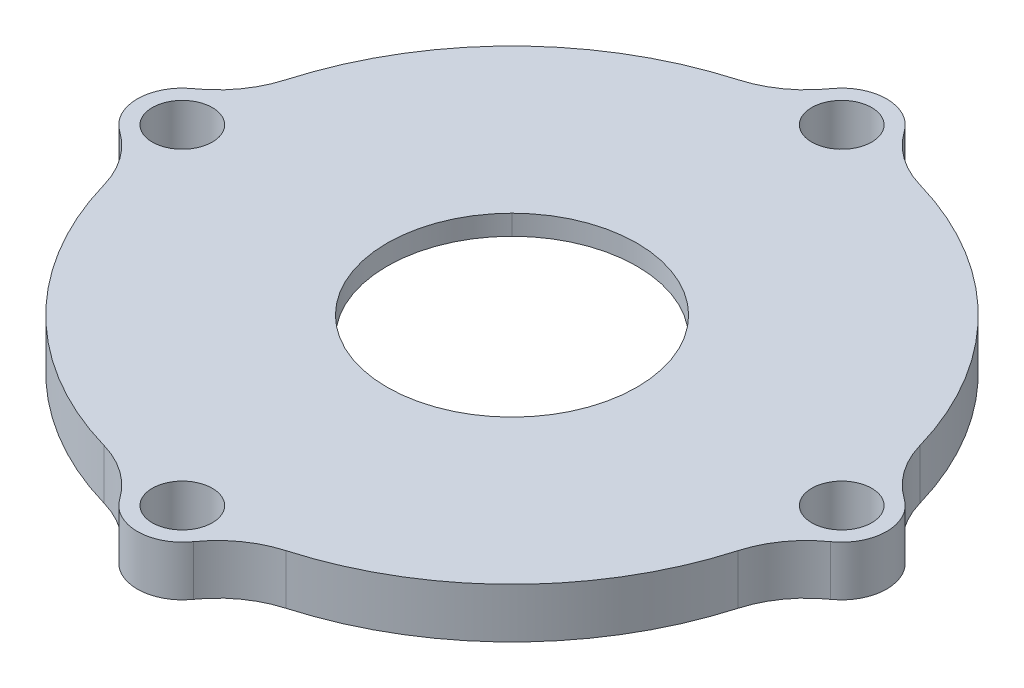
ISO-10303-21;
HEADER;
FILE_DESCRIPTION(('STEP AP214'),'2;1');
FILE_NAME('part.step','',(''),(''),'','','');
FILE_SCHEMA(('AUTOMOTIVE_DESIGN { 1 0 10303 214 1 1 1 1 }'));
ENDSEC;
DATA;
#1=APPLICATION_CONTEXT('core data for automotive mechanical design processes');
#2=APPLICATION_PROTOCOL_DEFINITION('international standard','automotive_design',2000,#1);
#3=PRODUCT_CONTEXT('',#1,'mechanical');
#4=PRODUCT('Part','Part','',(#3));
#5=PRODUCT_RELATED_PRODUCT_CATEGORY('part','',(#4));
#6=PRODUCT_DEFINITION_FORMATION('','',#4);
#7=PRODUCT_DEFINITION_CONTEXT('part definition',#1,'design');
#8=PRODUCT_DEFINITION('design','',#6,#7);
#9=PRODUCT_DEFINITION_SHAPE('','',#8);
#10=(LENGTH_UNIT() NAMED_UNIT(*) SI_UNIT(.MILLI.,.METRE.));
#11=(NAMED_UNIT(*) PLANE_ANGLE_UNIT() SI_UNIT($,.RADIAN.));
#12=(NAMED_UNIT(*) SI_UNIT($,.STERADIAN.) SOLID_ANGLE_UNIT());
#13=UNCERTAINTY_MEASURE_WITH_UNIT(LENGTH_MEASURE(1.E-05),#10,'distance_accuracy_value','');
#14=(GEOMETRIC_REPRESENTATION_CONTEXT(3) GLOBAL_UNCERTAINTY_ASSIGNED_CONTEXT((#13)) GLOBAL_UNIT_ASSIGNED_CONTEXT((#10,
#11,#12)) REPRESENTATION_CONTEXT('',''));
#15=CARTESIAN_POINT('',(0.,0.,0.));
#16=DIRECTION('',(0.,0.,1.));
#17=DIRECTION('',(1.,0.,0.));
#18=AXIS2_PLACEMENT_3D('',#15,#16,#17);
#19=CARTESIAN_POINT('',(0.,5.,0.));
#20=DIRECTION('',(0.,1.,0.));
#21=DIRECTION('',(0.,0.,1.));
#22=AXIS2_PLACEMENT_3D('',#19,#20,#21);
#23=PLANE('',#22);
#24=CARTESIAN_POINT('',(0.00100000000000606,5.,33.001));
#25=DIRECTION('',(0.,1.,0.));
#26=DIRECTION('',(0.,0.,1.));
#27=AXIS2_PLACEMENT_3D('',#24,#25,#26);
#28=CIRCLE('',#27,3.);
#29=CARTESIAN_POINT('',(0.00100000000000606,5.,36.001));
#30=VERTEX_POINT('',#29);
#31=EDGE_CURVE('E310',#30,#30,#28,.T.);
#32=ORIENTED_EDGE('',*,*,#31,.F.);
#33=EDGE_LOOP('',(#32));
#34=FACE_BOUND('',#33,.T.);
#35=CARTESIAN_POINT('',(0.00099999999999999,5.,0.00100000000000694));
#36=DIRECTION('',(0.,1.,0.));
#37=DIRECTION('',(0.,0.,1.));
#38=AXIS2_PLACEMENT_3D('',#35,#36,#37);
#39=CIRCLE('',#38,12.5);
#40=CARTESIAN_POINT('',(-8.83833475068976,5.,8.83933475068967));
#41=VERTEX_POINT('',#40);
#42=CARTESIAN_POINT('',(8.84033475068964,5.,8.83933475068979));
#43=VERTEX_POINT('',#42);
#44=EDGE_CURVE('E313',#41,#43,#39,.T.);
#45=ORIENTED_EDGE('',*,*,#44,.F.);
#46=CARTESIAN_POINT('',(0.,5.,0.));
#47=DIRECTION('',(0.,1.,0.));
#48=DIRECTION('',(0.,0.,1.));
#49=AXIS2_PLACEMENT_3D('',#46,#47,#48);
#50=CIRCLE('',#49,12.5);
#51=CARTESIAN_POINT('',(-8.8383347506897,5.,-8.83933475068973));
#52=VERTEX_POINT('',#51);
#53=EDGE_CURVE('E317',#52,#41,#50,.T.);
#54=ORIENTED_EDGE('',*,*,#53,.F.);
#55=CARTESIAN_POINT('',(0.001,5.,-0.00100000000000694));
#56=DIRECTION('',(0.,1.,0.));
#57=DIRECTION('',(0.,0.,1.));
#58=AXIS2_PLACEMENT_3D('',#55,#56,#57);
#59=CIRCLE('',#58,12.5);
#60=CARTESIAN_POINT('',(8.84033475068976,5.,-8.83933475068966));
#61=VERTEX_POINT('',#60);
#62=EDGE_CURVE('E320',#61,#52,#59,.T.);
#63=ORIENTED_EDGE('',*,*,#62,.F.);
#64=CARTESIAN_POINT('',(0.00200000000000694,5.,0.));
#65=DIRECTION('',(0.,1.,0.));
#66=DIRECTION('',(0.,0.,1.));
#67=AXIS2_PLACEMENT_3D('',#64,#65,#66);
#68=CIRCLE('',#67,12.5);
#69=EDGE_CURVE('E323',#43,#61,#68,.T.);
#70=ORIENTED_EDGE('',*,*,#69,.F.);
#71=EDGE_LOOP('',(#45,#54,#63,#70));
#72=FACE_BOUND('',#71,.T.);
#73=CARTESIAN_POINT('',(33.002,5.,0.));
#74=DIRECTION('',(0.,1.,0.));
#75=DIRECTION('',(0.,0.,1.));
#76=AXIS2_PLACEMENT_3D('',#73,#74,#75);
#77=CIRCLE('',#76,3.);
#78=CARTESIAN_POINT('',(33.002,5.,3.));
#79=VERTEX_POINT('',#78);
#80=EDGE_CURVE('E326',#79,#79,#77,.T.);
#81=ORIENTED_EDGE('',*,*,#80,.F.);
#82=EDGE_LOOP('',(#81));
#83=FACE_BOUND('',#82,.T.);
#84=CARTESIAN_POINT('',(0.000999999999997979,5.,-33.001));
#85=DIRECTION('',(0.,1.,0.));
#86=DIRECTION('',(0.,0.,1.));
#87=AXIS2_PLACEMENT_3D('',#84,#85,#86);
#88=CIRCLE('',#87,3.);
#89=CARTESIAN_POINT('',(0.000999999999997979,5.,-30.001));
#90=VERTEX_POINT('',#89);
#91=EDGE_CURVE('E329',#90,#90,#88,.T.);
#92=ORIENTED_EDGE('',*,*,#91,.F.);
#93=EDGE_LOOP('',(#92));
#94=FACE_BOUND('',#93,.T.);
#95=CARTESIAN_POINT('',(-33.,5.,0.));
#96=DIRECTION('',(0.,1.,0.));
#97=DIRECTION('',(0.,0.,1.));
#98=AXIS2_PLACEMENT_3D('',#95,#96,#97);
#99=CIRCLE('',#98,3.);
#100=CARTESIAN_POINT('',(-33.,5.,3.));
#101=VERTEX_POINT('',#100);
#102=EDGE_CURVE('E332',#101,#101,#99,.T.);
#103=ORIENTED_EDGE('',*,*,#102,.F.);
#104=EDGE_LOOP('',(#103));
#105=FACE_BOUND('',#104,.T.);
#106=CARTESIAN_POINT('',(0.,5.,0.));
#107=DIRECTION('',(0.,-1.,0.));
#108=DIRECTION('',(0.,0.,-1.));
#109=AXIS2_PLACEMENT_3D('',#106,#107,#108);
#110=CIRCLE('',#109,33.);
#111=CARTESIAN_POINT('',(-9.10862232961965,5.,31.718023255814));
#112=VERTEX_POINT('',#111);
#113=CARTESIAN_POINT('',(-31.7180232558139,5.,9.10862232961966));
#114=VERTEX_POINT('',#113);
#115=EDGE_CURVE('E189',#112,#114,#110,.T.);
#116=ORIENTED_EDGE('',*,*,#115,.F.);
#117=CARTESIAN_POINT('',(-11.8688109143529,5.,41.3295454545454));
#118=DIRECTION('',(0.,1.,0.));
#119=DIRECTION('',(0.,0.,1.));
#120=AXIS2_PLACEMENT_3D('',#117,#118,#119);
#121=CIRCLE('',#120,10.);
#122=CARTESIAN_POINT('',(-3.68342407686815,5.,35.5850313479624));
#123=VERTEX_POINT('',#122);
#124=EDGE_CURVE('E51',#123,#112,#121,.T.);
#125=ORIENTED_EDGE('',*,*,#124,.F.);
#126=CARTESIAN_POINT('',(0.,5.,33.));
#127=DIRECTION('',(0.,-1.,0.));
#128=DIRECTION('',(0.,0.,-1.));
#129=AXIS2_PLACEMENT_3D('',#126,#127,#128);
#130=CIRCLE('',#129,4.50000000000003);
#131=CARTESIAN_POINT('',(3.68342407686815,5.,35.5850313479624));
#132=VERTEX_POINT('',#131);
#133=EDGE_CURVE('E227',#132,#123,#130,.T.);
#134=ORIENTED_EDGE('',*,*,#133,.F.);
#135=CARTESIAN_POINT('',(11.8688109143529,5.,41.3295454545454));
#136=DIRECTION('',(0.,1.,0.));
#137=DIRECTION('',(0.,0.,-1.));
#138=AXIS2_PLACEMENT_3D('',#135,#136,#137);
#139=CIRCLE('',#138,10.);
#140=CARTESIAN_POINT('',(9.10862232961966,5.,31.7180232558139));
#141=VERTEX_POINT('',#140);
#142=EDGE_CURVE('E224',#141,#132,#139,.T.);
#143=ORIENTED_EDGE('',*,*,#142,.F.);
#144=CARTESIAN_POINT('',(0.,5.,0.));
#145=DIRECTION('',(0.,-1.,0.));
#146=DIRECTION('',(0.,0.,-1.));
#147=AXIS2_PLACEMENT_3D('',#144,#145,#146);
#148=CIRCLE('',#147,33.);
#149=CARTESIAN_POINT('',(31.718023255814,5.,9.1086223296196));
#150=VERTEX_POINT('',#149);
#151=EDGE_CURVE('E221',#150,#141,#148,.T.);
#152=ORIENTED_EDGE('',*,*,#151,.F.);
#153=CARTESIAN_POINT('',(41.3295454545455,5.,11.8688109143528));
#154=DIRECTION('',(0.,1.,0.));
#155=DIRECTION('',(0.,0.,1.));
#156=AXIS2_PLACEMENT_3D('',#153,#154,#155);
#157=CIRCLE('',#156,10.);
#158=CARTESIAN_POINT('',(35.5850313479624,5.,3.6834240768681));
#159=VERTEX_POINT('',#158);
#160=EDGE_CURVE('E218',#159,#150,#157,.T.);
#161=ORIENTED_EDGE('',*,*,#160,.F.);
#162=CARTESIAN_POINT('',(33.,5.,0.));
#163=DIRECTION('',(0.,-1.,0.));
#164=DIRECTION('',(0.,0.,-1.));
#165=AXIS2_PLACEMENT_3D('',#162,#163,#164);
#166=CIRCLE('',#165,4.49999999999998);
#167=CARTESIAN_POINT('',(35.5850313479624,5.,-3.6834240768681));
#168=VERTEX_POINT('',#167);
#169=EDGE_CURVE('E216',#168,#159,#166,.T.);
#170=ORIENTED_EDGE('',*,*,#169,.F.);
#171=CARTESIAN_POINT('',(41.3295454545455,5.,-11.8688109143528));
#172=DIRECTION('',(0.,1.,0.));
#173=DIRECTION('',(0.,0.,-1.));
#174=AXIS2_PLACEMENT_3D('',#171,#172,#173);
#175=CIRCLE('',#174,10.);
#176=CARTESIAN_POINT('',(31.718023255814,5.,-9.1086223296196));
#177=VERTEX_POINT('',#176);
#178=EDGE_CURVE('E213',#177,#168,#175,.T.);
#179=ORIENTED_EDGE('',*,*,#178,.F.);
#180=CARTESIAN_POINT('',(0.,5.,0.));
#181=DIRECTION('',(0.,-1.,0.));
#182=DIRECTION('',(0.,0.,-1.));
#183=AXIS2_PLACEMENT_3D('',#180,#181,#182);
#184=CIRCLE('',#183,33.);
#185=CARTESIAN_POINT('',(9.1086223296196,5.,-31.718023255814));
#186=VERTEX_POINT('',#185);
#187=EDGE_CURVE('E210',#186,#177,#184,.T.);
#188=ORIENTED_EDGE('',*,*,#187,.F.);
#189=CARTESIAN_POINT('',(11.8688109143528,5.,-41.3295454545455));
#190=DIRECTION('',(0.,1.,0.));
#191=DIRECTION('',(0.,0.,1.));
#192=AXIS2_PLACEMENT_3D('',#189,#190,#191);
#193=CIRCLE('',#192,10.);
#194=CARTESIAN_POINT('',(3.6834240768681,5.,-35.5850313479624));
#195=VERTEX_POINT('',#194);
#196=EDGE_CURVE('E207',#195,#186,#193,.T.);
#197=ORIENTED_EDGE('',*,*,#196,.F.);
#198=CARTESIAN_POINT('',(0.,5.,-33.));
#199=DIRECTION('',(0.,-1.,0.));
#200=DIRECTION('',(0.,0.,-1.));
#201=AXIS2_PLACEMENT_3D('',#198,#199,#200);
#202=CIRCLE('',#201,4.49999999999998);
#203=CARTESIAN_POINT('',(-3.6834240768681,5.,-35.5850313479624));
#204=VERTEX_POINT('',#203);
#205=EDGE_CURVE('E205',#204,#195,#202,.T.);
#206=ORIENTED_EDGE('',*,*,#205,.F.);
#207=CARTESIAN_POINT('',(-11.8688109143528,5.,-41.3295454545455));
#208=DIRECTION('',(0.,1.,0.));
#209=DIRECTION('',(0.,0.,-1.));
#210=AXIS2_PLACEMENT_3D('',#207,#208,#209);
#211=CIRCLE('',#210,10.);
#212=CARTESIAN_POINT('',(-9.1086223296196,5.,-31.718023255814));
#213=VERTEX_POINT('',#212);
#214=EDGE_CURVE('E202',#213,#204,#211,.T.);
#215=ORIENTED_EDGE('',*,*,#214,.F.);
#216=CARTESIAN_POINT('',(0.,5.,0.));
#217=DIRECTION('',(0.,-1.,0.));
#218=DIRECTION('',(0.,0.,-1.));
#219=AXIS2_PLACEMENT_3D('',#216,#217,#218);
#220=CIRCLE('',#219,33.);
#221=CARTESIAN_POINT('',(-31.718023255814,5.,-9.10862232961965));
#222=VERTEX_POINT('',#221);
#223=EDGE_CURVE('E196',#222,#213,#220,.T.);
#224=ORIENTED_EDGE('',*,*,#223,.F.);
#225=CARTESIAN_POINT('',(-41.3295454545454,5.,-11.8688109143529));
#226=DIRECTION('',(0.,1.,0.));
#227=DIRECTION('',(0.,0.,1.));
#228=AXIS2_PLACEMENT_3D('',#225,#226,#227);
#229=CIRCLE('',#228,10.);
#230=CARTESIAN_POINT('',(-35.5850313479624,5.,-3.68342407686815));
#231=VERTEX_POINT('',#230);
#232=EDGE_CURVE('E194',#231,#222,#229,.T.);
#233=ORIENTED_EDGE('',*,*,#232,.F.);
#234=CARTESIAN_POINT('',(-33.,5.,0.));
#235=DIRECTION('',(0.,-1.,0.));
#236=DIRECTION('',(0.,0.,-1.));
#237=AXIS2_PLACEMENT_3D('',#234,#235,#236);
#238=CIRCLE('',#237,4.50000000000003);
#239=CARTESIAN_POINT('',(-35.5850313479624,5.,3.68342407686816));
#240=VERTEX_POINT('',#239);
#241=EDGE_CURVE('E176',#240,#231,#238,.T.);
#242=ORIENTED_EDGE('',*,*,#241,.F.);
#243=CARTESIAN_POINT('',(-41.3295454545454,5.,11.8688109143529));
#244=DIRECTION('',(0.,1.,0.));
#245=DIRECTION('',(0.,0.,-1.));
#246=AXIS2_PLACEMENT_3D('',#243,#244,#245);
#247=CIRCLE('',#246,10.);
#248=EDGE_CURVE('E184',#114,#240,#247,.T.);
#249=ORIENTED_EDGE('',*,*,#248,.F.);
#250=EDGE_LOOP('',(#116,#125,#134,#143,#152,#161,#170,#179,#188,#197,#206,#215,#224,#233,#242,#249));
#251=FACE_BOUND('',#250,.T.);
#252=ADVANCED_FACE('F36',(#34,#72,#83,#94,#105,#251),#23,.T.);
#253=CARTESIAN_POINT('',(0.,0.,0.));
#254=DIRECTION('',(0.,1.,0.));
#255=DIRECTION('',(0.,0.,1.));
#256=AXIS2_PLACEMENT_3D('',#253,#254,#255);
#257=PLANE('',#256);
#258=CARTESIAN_POINT('',(0.,0.,0.));
#259=DIRECTION('',(0.,-1.,0.));
#260=DIRECTION('',(0.,0.,-1.));
#261=AXIS2_PLACEMENT_3D('',#258,#259,#260);
#262=CIRCLE('',#261,27.75);
#263=CARTESIAN_POINT('',(0.,0.,-27.75));
#264=VERTEX_POINT('',#263);
#265=EDGE_CURVE('E266',#264,#264,#262,.T.);
#266=ORIENTED_EDGE('',*,*,#265,.F.);
#267=EDGE_LOOP('',(#266));
#268=FACE_BOUND('',#267,.T.);
#269=CARTESIAN_POINT('',(0.00100000000000606,0.,33.001));
#270=DIRECTION('',(0.,1.,0.));
#271=DIRECTION('',(0.,0.,1.));
#272=AXIS2_PLACEMENT_3D('',#269,#270,#271);
#273=CIRCLE('',#272,3.);
#274=CARTESIAN_POINT('',(0.00100000000000606,0.,36.001));
#275=VERTEX_POINT('',#274);
#276=EDGE_CURVE('E309',#275,#275,#273,.T.);
#277=ORIENTED_EDGE('',*,*,#276,.T.);
#278=EDGE_LOOP('',(#277));
#279=FACE_BOUND('',#278,.T.);
#280=CARTESIAN_POINT('',(33.002,0.,0.));
#281=DIRECTION('',(0.,1.,0.));
#282=DIRECTION('',(0.,0.,1.));
#283=AXIS2_PLACEMENT_3D('',#280,#281,#282);
#284=CIRCLE('',#283,3.);
#285=CARTESIAN_POINT('',(33.002,0.,3.));
#286=VERTEX_POINT('',#285);
#287=EDGE_CURVE('E338',#286,#286,#284,.T.);
#288=ORIENTED_EDGE('',*,*,#287,.T.);
#289=EDGE_LOOP('',(#288));
#290=FACE_BOUND('',#289,.T.);
#291=CARTESIAN_POINT('',(0.000999999999997979,0.,-33.001));
#292=DIRECTION('',(0.,1.,0.));
#293=DIRECTION('',(0.,0.,1.));
#294=AXIS2_PLACEMENT_3D('',#291,#292,#293);
#295=CIRCLE('',#294,3.);
#296=CARTESIAN_POINT('',(0.000999999999997979,0.,-30.001));
#297=VERTEX_POINT('',#296);
#298=EDGE_CURVE('E341',#297,#297,#295,.T.);
#299=ORIENTED_EDGE('',*,*,#298,.T.);
#300=EDGE_LOOP('',(#299));
#301=FACE_BOUND('',#300,.T.);
#302=CARTESIAN_POINT('',(-33.,0.,0.));
#303=DIRECTION('',(0.,1.,0.));
#304=DIRECTION('',(0.,0.,1.));
#305=AXIS2_PLACEMENT_3D('',#302,#303,#304);
#306=CIRCLE('',#305,3.);
#307=CARTESIAN_POINT('',(-33.,0.,3.));
#308=VERTEX_POINT('',#307);
#309=EDGE_CURVE('E314',#308,#308,#306,.T.);
#310=ORIENTED_EDGE('',*,*,#309,.T.);
#311=EDGE_LOOP('',(#310));
#312=FACE_BOUND('',#311,.T.);
#313=CARTESIAN_POINT('',(-11.8688109143529,0.,41.3295454545454));
#314=DIRECTION('',(0.,1.,0.));
#315=DIRECTION('',(0.,0.,1.));
#316=AXIS2_PLACEMENT_3D('',#313,#314,#315);
#317=CIRCLE('',#316,10.);
#318=CARTESIAN_POINT('',(-3.68342407686815,0.,35.5850313479624));
#319=VERTEX_POINT('',#318);
#320=CARTESIAN_POINT('',(-9.10862232961965,0.,31.718023255814));
#321=VERTEX_POINT('',#320);
#322=EDGE_CURVE('E230',#319,#321,#317,.T.);
#323=ORIENTED_EDGE('',*,*,#322,.T.);
#324=CARTESIAN_POINT('',(0.,0.,0.));
#325=DIRECTION('',(0.,-1.,0.));
#326=DIRECTION('',(0.,0.,-1.));
#327=AXIS2_PLACEMENT_3D('',#324,#325,#326);
#328=CIRCLE('',#327,33.);
#329=CARTESIAN_POINT('',(-31.7180232558139,0.,9.10862232961966));
#330=VERTEX_POINT('',#329);
#331=EDGE_CURVE('E233',#321,#330,#328,.T.);
#332=ORIENTED_EDGE('',*,*,#331,.T.);
#333=CARTESIAN_POINT('',(-41.3295454545454,0.,11.8688109143529));
#334=DIRECTION('',(0.,1.,0.));
#335=DIRECTION('',(0.,0.,-1.));
#336=AXIS2_PLACEMENT_3D('',#333,#334,#335);
#337=CIRCLE('',#336,10.);
#338=CARTESIAN_POINT('',(-35.5850313479624,0.,3.68342407686816));
#339=VERTEX_POINT('',#338);
#340=EDGE_CURVE('E59',#330,#339,#337,.T.);
#341=ORIENTED_EDGE('',*,*,#340,.T.);
#342=CARTESIAN_POINT('',(-33.,0.,0.));
#343=DIRECTION('',(0.,1.,0.));
#344=DIRECTION('',(0.,0.,1.));
#345=AXIS2_PLACEMENT_3D('',#342,#343,#344);
#346=CIRCLE('',#345,4.50000000000003);
#347=CARTESIAN_POINT('',(-35.5850313479624,0.,-3.68342407686815));
#348=VERTEX_POINT('',#347);
#349=EDGE_CURVE('E179',#348,#339,#346,.T.);
#350=ORIENTED_EDGE('',*,*,#349,.F.);
#351=CARTESIAN_POINT('',(-41.3295454545454,0.,-11.8688109143529));
#352=DIRECTION('',(0.,1.,0.));
#353=DIRECTION('',(0.,0.,1.));
#354=AXIS2_PLACEMENT_3D('',#351,#352,#353);
#355=CIRCLE('',#354,10.);
#356=CARTESIAN_POINT('',(-31.718023255814,0.,-9.10862232961965));
#357=VERTEX_POINT('',#356);
#358=EDGE_CURVE('E237',#348,#357,#355,.T.);
#359=ORIENTED_EDGE('',*,*,#358,.T.);
#360=CARTESIAN_POINT('',(0.,0.,0.));
#361=DIRECTION('',(0.,-1.,0.));
#362=DIRECTION('',(0.,0.,-1.));
#363=AXIS2_PLACEMENT_3D('',#360,#361,#362);
#364=CIRCLE('',#363,33.);
#365=CARTESIAN_POINT('',(-9.1086223296196,0.,-31.718023255814));
#366=VERTEX_POINT('',#365);
#367=EDGE_CURVE('E240',#357,#366,#364,.T.);
#368=ORIENTED_EDGE('',*,*,#367,.T.);
#369=CARTESIAN_POINT('',(-11.8688109143528,0.,-41.3295454545455));
#370=DIRECTION('',(0.,1.,0.));
#371=DIRECTION('',(0.,0.,-1.));
#372=AXIS2_PLACEMENT_3D('',#369,#370,#371);
#373=CIRCLE('',#372,10.);
#374=CARTESIAN_POINT('',(-3.6834240768681,0.,-35.5850313479624));
#375=VERTEX_POINT('',#374);
#376=EDGE_CURVE('E243',#366,#375,#373,.T.);
#377=ORIENTED_EDGE('',*,*,#376,.T.);
#378=CARTESIAN_POINT('',(0.,0.,-33.));
#379=DIRECTION('',(0.,1.,0.));
#380=DIRECTION('',(0.,0.,1.));
#381=AXIS2_PLACEMENT_3D('',#378,#379,#380);
#382=CIRCLE('',#381,4.49999999999998);
#383=CARTESIAN_POINT('',(3.6834240768681,0.,-35.5850313479624));
#384=VERTEX_POINT('',#383);
#385=EDGE_CURVE('E361',#384,#375,#382,.T.);
#386=ORIENTED_EDGE('',*,*,#385,.F.);
#387=CARTESIAN_POINT('',(11.8688109143528,0.,-41.3295454545455));
#388=DIRECTION('',(0.,1.,0.));
#389=DIRECTION('',(0.,0.,1.));
#390=AXIS2_PLACEMENT_3D('',#387,#388,#389);
#391=CIRCLE('',#390,10.);
#392=CARTESIAN_POINT('',(9.1086223296196,0.,-31.718023255814));
#393=VERTEX_POINT('',#392);
#394=EDGE_CURVE('E246',#384,#393,#391,.T.);
#395=ORIENTED_EDGE('',*,*,#394,.T.);
#396=CARTESIAN_POINT('',(0.,0.,0.));
#397=DIRECTION('',(0.,-1.,0.));
#398=DIRECTION('',(0.,0.,-1.));
#399=AXIS2_PLACEMENT_3D('',#396,#397,#398);
#400=CIRCLE('',#399,33.);
#401=CARTESIAN_POINT('',(31.718023255814,0.,-9.1086223296196));
#402=VERTEX_POINT('',#401);
#403=EDGE_CURVE('E249',#393,#402,#400,.T.);
#404=ORIENTED_EDGE('',*,*,#403,.T.);
#405=CARTESIAN_POINT('',(41.3295454545455,0.,-11.8688109143528));
#406=DIRECTION('',(0.,1.,0.));
#407=DIRECTION('',(0.,0.,-1.));
#408=AXIS2_PLACEMENT_3D('',#405,#406,#407);
#409=CIRCLE('',#408,10.);
#410=CARTESIAN_POINT('',(35.5850313479624,0.,-3.6834240768681));
#411=VERTEX_POINT('',#410);
#412=EDGE_CURVE('E252',#402,#411,#409,.T.);
#413=ORIENTED_EDGE('',*,*,#412,.T.);
#414=CARTESIAN_POINT('',(33.,0.,0.));
#415=DIRECTION('',(0.,1.,0.));
#416=DIRECTION('',(0.,0.,1.));
#417=AXIS2_PLACEMENT_3D('',#414,#415,#416);
#418=CIRCLE('',#417,4.49999999999998);
#419=CARTESIAN_POINT('',(35.5850313479624,0.,3.6834240768681));
#420=VERTEX_POINT('',#419);
#421=EDGE_CURVE('E44',#420,#411,#418,.T.);
#422=ORIENTED_EDGE('',*,*,#421,.F.);
#423=CARTESIAN_POINT('',(41.3295454545455,0.,11.8688109143528));
#424=DIRECTION('',(0.,1.,0.));
#425=DIRECTION('',(0.,0.,1.));
#426=AXIS2_PLACEMENT_3D('',#423,#424,#425);
#427=CIRCLE('',#426,10.);
#428=CARTESIAN_POINT('',(31.718023255814,0.,9.1086223296196));
#429=VERTEX_POINT('',#428);
#430=EDGE_CURVE('E255',#420,#429,#427,.T.);
#431=ORIENTED_EDGE('',*,*,#430,.T.);
#432=CARTESIAN_POINT('',(0.,0.,0.));
#433=DIRECTION('',(0.,-1.,0.));
#434=DIRECTION('',(0.,0.,-1.));
#435=AXIS2_PLACEMENT_3D('',#432,#433,#434);
#436=CIRCLE('',#435,33.);
#437=CARTESIAN_POINT('',(9.10862232961966,0.,31.7180232558139));
#438=VERTEX_POINT('',#437);
#439=EDGE_CURVE('E258',#429,#438,#436,.T.);
#440=ORIENTED_EDGE('',*,*,#439,.T.);
#441=CARTESIAN_POINT('',(11.8688109143529,0.,41.3295454545454));
#442=DIRECTION('',(0.,1.,0.));
#443=DIRECTION('',(0.,0.,-1.));
#444=AXIS2_PLACEMENT_3D('',#441,#442,#443);
#445=CIRCLE('',#444,10.);
#446=CARTESIAN_POINT('',(3.68342407686815,0.,35.5850313479624));
#447=VERTEX_POINT('',#446);
#448=EDGE_CURVE('E261',#438,#447,#445,.T.);
#449=ORIENTED_EDGE('',*,*,#448,.T.);
#450=CARTESIAN_POINT('',(0.,0.,33.));
#451=DIRECTION('',(0.,1.,0.));
#452=DIRECTION('',(0.,0.,1.));
#453=AXIS2_PLACEMENT_3D('',#450,#451,#452);
#454=CIRCLE('',#453,4.50000000000003);
#455=EDGE_CURVE('E12',#319,#447,#454,.T.);
#456=ORIENTED_EDGE('',*,*,#455,.F.);
#457=EDGE_LOOP('',(#323,#332,#341,#350,#359,#368,#377,#386,#395,#404,#413,#422,#431,#440,#449,#456));
#458=FACE_BOUND('',#457,.T.);
#459=ADVANCED_FACE('F373',(#268,#279,#290,#301,#312,#458),#257,.F.);
#460=CARTESIAN_POINT('',(0.00099999999999999,5.,0.00100000000000694));
#461=DIRECTION('',(0.,-1.,0.));
#462=DIRECTION('',(0.,0.,-1.));
#463=AXIS2_PLACEMENT_3D('',#460,#461,#462);
#464=CYLINDRICAL_SURFACE('',#463,12.5);
#465=DIRECTION('',(0.,-1.,0.));
#466=VECTOR('',#465,1.);
#467=CARTESIAN_POINT('',(8.84033475068964,5.,8.83933475068979));
#468=LINE('',#467,#466);
#469=CARTESIAN_POINT('',(8.84033475068964,3.,8.83933475068979));
#470=VERTEX_POINT('',#469);
#471=EDGE_CURVE('E335',#43,#470,#468,.T.);
#472=ORIENTED_EDGE('',*,*,#471,.T.);
#473=CARTESIAN_POINT('',(0.00099999999999999,3.,0.00100000000000694));
#474=DIRECTION('',(0.,-1.,0.));
#475=DIRECTION('',(0.,0.,-1.));
#476=AXIS2_PLACEMENT_3D('',#473,#474,#475);
#477=CIRCLE('',#476,12.5);
#478=CARTESIAN_POINT('',(-8.83833475068976,3.,8.83933475068967));
#479=VERTEX_POINT('',#478);
#480=EDGE_CURVE('E306',#470,#479,#477,.T.);
#481=ORIENTED_EDGE('',*,*,#480,.T.);
#482=DIRECTION('',(0.,-1.,0.));
#483=VECTOR('',#482,1.);
#484=CARTESIAN_POINT('',(-8.83833475068976,5.,8.83933475068967));
#485=LINE('',#484,#483);
#486=EDGE_CURVE('E354',#41,#479,#485,.T.);
#487=ORIENTED_EDGE('',*,*,#486,.F.);
#488=ORIENTED_EDGE('',*,*,#44,.T.);
#489=EDGE_LOOP('',(#472,#481,#487,#488));
#490=FACE_BOUND('',#489,.T.);
#491=ADVANCED_FACE('F416',(#490),#464,.F.);
#492=CARTESIAN_POINT('',(0.,5.,0.));
#493=DIRECTION('',(0.,-1.,0.));
#494=DIRECTION('',(0.,0.,-1.));
#495=AXIS2_PLACEMENT_3D('',#492,#493,#494);
#496=CYLINDRICAL_SURFACE('',#495,12.5);
#497=ORIENTED_EDGE('',*,*,#486,.T.);
#498=CARTESIAN_POINT('',(0.,3.,0.));
#499=DIRECTION('',(0.,-1.,0.));
#500=DIRECTION('',(0.,0.,-1.));
#501=AXIS2_PLACEMENT_3D('',#498,#499,#500);
#502=CIRCLE('',#501,12.5);
#503=CARTESIAN_POINT('',(-8.8383347506897,3.,-8.83933475068973));
#504=VERTEX_POINT('',#503);
#505=EDGE_CURVE('E303',#479,#504,#502,.T.);
#506=ORIENTED_EDGE('',*,*,#505,.T.);
#507=DIRECTION('',(0.,-1.,0.));
#508=VECTOR('',#507,1.);
#509=CARTESIAN_POINT('',(-8.8383347506897,5.,-8.83933475068973));
#510=LINE('',#509,#508);
#511=EDGE_CURVE('E351',#52,#504,#510,.T.);
#512=ORIENTED_EDGE('',*,*,#511,.F.);
#513=ORIENTED_EDGE('',*,*,#53,.T.);
#514=EDGE_LOOP('',(#497,#506,#512,#513));
#515=FACE_BOUND('',#514,.T.);
#516=ADVANCED_FACE('F444',(#515),#496,.F.);
#517=CARTESIAN_POINT('',(0.001,5.,-0.00100000000000694));
#518=DIRECTION('',(0.,-1.,0.));
#519=DIRECTION('',(0.,0.,-1.));
#520=AXIS2_PLACEMENT_3D('',#517,#518,#519);
#521=CYLINDRICAL_SURFACE('',#520,12.5);
#522=ORIENTED_EDGE('',*,*,#511,.T.);
#523=CARTESIAN_POINT('',(0.001,3.,-0.00100000000000694));
#524=DIRECTION('',(0.,-1.,0.));
#525=DIRECTION('',(0.,0.,-1.));
#526=AXIS2_PLACEMENT_3D('',#523,#524,#525);
#527=CIRCLE('',#526,12.5);
#528=CARTESIAN_POINT('',(8.84033475068976,3.,-8.83933475068967));
#529=VERTEX_POINT('',#528);
#530=EDGE_CURVE('E298',#504,#529,#527,.T.);
#531=ORIENTED_EDGE('',*,*,#530,.T.);
#532=DIRECTION('',(0.,-1.,0.));
#533=VECTOR('',#532,1.);
#534=CARTESIAN_POINT('',(8.84033475068976,5.,-8.83933475068966));
#535=LINE('',#534,#533);
#536=EDGE_CURVE('E348',#61,#529,#535,.T.);
#537=ORIENTED_EDGE('',*,*,#536,.F.);
#538=ORIENTED_EDGE('',*,*,#62,.T.);
#539=EDGE_LOOP('',(#522,#531,#537,#538));
#540=FACE_BOUND('',#539,.T.);
#541=ADVANCED_FACE('F440',(#540),#521,.F.);
#542=CARTESIAN_POINT('',(0.00200000000000694,5.,0.));
#543=DIRECTION('',(0.,-1.,0.));
#544=DIRECTION('',(0.,0.,-1.));
#545=AXIS2_PLACEMENT_3D('',#542,#543,#544);
#546=CYLINDRICAL_SURFACE('',#545,12.5);
#547=ORIENTED_EDGE('',*,*,#536,.T.);
#548=CARTESIAN_POINT('',(0.00200000000000694,3.,0.));
#549=DIRECTION('',(0.,-1.,0.));
#550=DIRECTION('',(0.,0.,-1.));
#551=AXIS2_PLACEMENT_3D('',#548,#549,#550);
#552=CIRCLE('',#551,12.5);
#553=EDGE_CURVE('E357',#529,#470,#552,.T.);
#554=ORIENTED_EDGE('',*,*,#553,.T.);
#555=ORIENTED_EDGE('',*,*,#471,.F.);
#556=ORIENTED_EDGE('',*,*,#69,.T.);
#557=EDGE_LOOP('',(#547,#554,#555,#556));
#558=FACE_BOUND('',#557,.T.);
#559=ADVANCED_FACE('F429',(#558),#546,.F.);
#560=CARTESIAN_POINT('',(-33.,5.,0.));
#561=DIRECTION('',(0.,-1.,0.));
#562=DIRECTION('',(0.,0.,-1.));
#563=AXIS2_PLACEMENT_3D('',#560,#561,#562);
#564=CYLINDRICAL_SURFACE('',#563,3.);
#565=ORIENTED_EDGE('',*,*,#102,.T.);
#566=EDGE_LOOP('',(#565));
#567=FACE_BOUND('',#566,.T.);
#568=ORIENTED_EDGE('',*,*,#309,.F.);
#569=EDGE_LOOP('',(#568));
#570=FACE_BOUND('',#569,.T.);
#571=ADVANCED_FACE('F425',(#567,#570),#564,.F.);
#572=CARTESIAN_POINT('',(0.000999999999997979,5.,-33.001));
#573=DIRECTION('',(0.,-1.,0.));
#574=DIRECTION('',(0.,0.,-1.));
#575=AXIS2_PLACEMENT_3D('',#572,#573,#574);
#576=CYLINDRICAL_SURFACE('',#575,3.);
#577=ORIENTED_EDGE('',*,*,#91,.T.);
#578=EDGE_LOOP('',(#577));
#579=FACE_BOUND('',#578,.T.);
#580=ORIENTED_EDGE('',*,*,#298,.F.);
#581=EDGE_LOOP('',(#580));
#582=FACE_BOUND('',#581,.T.);
#583=ADVANCED_FACE('F428',(#579,#582),#576,.F.);
#584=CARTESIAN_POINT('',(33.002,5.,0.));
#585=DIRECTION('',(0.,-1.,0.));
#586=DIRECTION('',(0.,0.,-1.));
#587=AXIS2_PLACEMENT_3D('',#584,#585,#586);
#588=CYLINDRICAL_SURFACE('',#587,3.);
#589=ORIENTED_EDGE('',*,*,#80,.T.);
#590=EDGE_LOOP('',(#589));
#591=FACE_BOUND('',#590,.T.);
#592=ORIENTED_EDGE('',*,*,#287,.F.);
#593=EDGE_LOOP('',(#592));
#594=FACE_BOUND('',#593,.T.);
#595=ADVANCED_FACE('F433',(#591,#594),#588,.F.);
#596=CARTESIAN_POINT('',(0.00100000000000606,5.,33.001));
#597=DIRECTION('',(0.,-1.,0.));
#598=DIRECTION('',(0.,0.,-1.));
#599=AXIS2_PLACEMENT_3D('',#596,#597,#598);
#600=CYLINDRICAL_SURFACE('',#599,3.);
#601=ORIENTED_EDGE('',*,*,#31,.T.);
#602=EDGE_LOOP('',(#601));
#603=FACE_BOUND('',#602,.T.);
#604=ORIENTED_EDGE('',*,*,#276,.F.);
#605=EDGE_LOOP('',(#604));
#606=FACE_BOUND('',#605,.T.);
#607=ADVANCED_FACE('F38',(#603,#606),#600,.F.);
#608=CARTESIAN_POINT('',(0.,3.,0.));
#609=DIRECTION('',(0.,-1.,0.));
#610=DIRECTION('',(0.,0.,-1.));
#611=AXIS2_PLACEMENT_3D('',#608,#609,#610);
#612=CYLINDRICAL_SURFACE('',#611,27.75);
#613=CARTESIAN_POINT('',(0.,3.,0.));
#614=DIRECTION('',(0.,-1.,0.));
#615=DIRECTION('',(0.,0.,-1.));
#616=AXIS2_PLACEMENT_3D('',#613,#614,#615);
#617=CIRCLE('',#616,27.75);
#618=CARTESIAN_POINT('',(0.,3.,-27.75));
#619=VERTEX_POINT('',#618);
#620=EDGE_CURVE('E295',#619,#619,#617,.T.);
#621=ORIENTED_EDGE('',*,*,#620,.F.);
#622=EDGE_LOOP('',(#621));
#623=FACE_BOUND('',#622,.T.);
#624=ORIENTED_EDGE('',*,*,#265,.T.);
#625=EDGE_LOOP('',(#624));
#626=FACE_BOUND('',#625,.T.);
#627=ADVANCED_FACE('F422',(#623,#626),#612,.F.);
#628=CARTESIAN_POINT('',(0.,3.,0.));
#629=DIRECTION('',(0.,-1.,0.));
#630=DIRECTION('',(0.,0.,-1.));
#631=AXIS2_PLACEMENT_3D('',#628,#629,#630);
#632=PLANE('',#631);
#633=ORIENTED_EDGE('',*,*,#553,.F.);
#634=ORIENTED_EDGE('',*,*,#530,.F.);
#635=ORIENTED_EDGE('',*,*,#505,.F.);
#636=ORIENTED_EDGE('',*,*,#480,.F.);
#637=EDGE_LOOP('',(#633,#634,#635,#636));
#638=FACE_BOUND('',#637,.T.);
#639=ORIENTED_EDGE('',*,*,#620,.T.);
#640=EDGE_LOOP('',(#639));
#641=FACE_BOUND('',#640,.T.);
#642=ADVANCED_FACE('F455',(#638,#641),#632,.T.);
#643=CARTESIAN_POINT('',(0.,5.,33.));
#644=DIRECTION('',(0.,-1.,0.));
#645=DIRECTION('',(0.,0.,-1.));
#646=AXIS2_PLACEMENT_3D('',#643,#644,#645);
#647=CYLINDRICAL_SURFACE('',#646,4.50000000000003);
#648=ORIENTED_EDGE('',*,*,#133,.T.);
#649=DIRECTION('',(0.,-1.,0.));
#650=VECTOR('',#649,1.);
#651=CARTESIAN_POINT('',(-3.68342407686815,5.,35.5850313479624));
#652=LINE('',#651,#650);
#653=EDGE_CURVE('E264',#123,#319,#652,.T.);
#654=ORIENTED_EDGE('',*,*,#653,.T.);
#655=ORIENTED_EDGE('',*,*,#455,.T.);
#656=DIRECTION('',(0.,-1.,0.));
#657=VECTOR('',#656,1.);
#658=CARTESIAN_POINT('',(3.68342407686815,5.,35.5850313479624));
#659=LINE('',#658,#657);
#660=EDGE_CURVE('E267',#132,#447,#659,.T.);
#661=ORIENTED_EDGE('',*,*,#660,.F.);
#662=EDGE_LOOP('',(#648,#654,#655,#661));
#663=FACE_BOUND('',#662,.T.);
#664=ADVANCED_FACE('F395',(#663),#647,.T.);
#665=CARTESIAN_POINT('',(33.,5.,0.));
#666=DIRECTION('',(0.,-1.,0.));
#667=DIRECTION('',(0.,0.,-1.));
#668=AXIS2_PLACEMENT_3D('',#665,#666,#667);
#669=CYLINDRICAL_SURFACE('',#668,4.49999999999998);
#670=DIRECTION('',(0.,-1.,0.));
#671=VECTOR('',#670,1.);
#672=CARTESIAN_POINT('',(35.5850313479624,5.,-3.6834240768681));
#673=LINE('',#672,#671);
#674=EDGE_CURVE('E276',#168,#411,#673,.T.);
#675=ORIENTED_EDGE('',*,*,#674,.F.);
#676=ORIENTED_EDGE('',*,*,#169,.T.);
#677=DIRECTION('',(0.,-1.,0.));
#678=VECTOR('',#677,1.);
#679=CARTESIAN_POINT('',(35.5850313479624,5.,3.6834240768681));
#680=LINE('',#679,#678);
#681=EDGE_CURVE('E274',#159,#420,#680,.T.);
#682=ORIENTED_EDGE('',*,*,#681,.T.);
#683=ORIENTED_EDGE('',*,*,#421,.T.);
#684=EDGE_LOOP('',(#675,#676,#682,#683));
#685=FACE_BOUND('',#684,.T.);
#686=ADVANCED_FACE('F365',(#685),#669,.T.);
#687=CARTESIAN_POINT('',(0.,5.,-33.));
#688=DIRECTION('',(0.,-1.,0.));
#689=DIRECTION('',(0.,0.,-1.));
#690=AXIS2_PLACEMENT_3D('',#687,#688,#689);
#691=CYLINDRICAL_SURFACE('',#690,4.49999999999998);
#692=DIRECTION('',(0.,-1.,0.));
#693=VECTOR('',#692,1.);
#694=CARTESIAN_POINT('',(-3.6834240768681,5.,-35.5850313479624));
#695=LINE('',#694,#693);
#696=EDGE_CURVE('E285',#204,#375,#695,.T.);
#697=ORIENTED_EDGE('',*,*,#696,.F.);
#698=ORIENTED_EDGE('',*,*,#205,.T.);
#699=DIRECTION('',(0.,-1.,0.));
#700=VECTOR('',#699,1.);
#701=CARTESIAN_POINT('',(3.6834240768681,5.,-35.5850313479624));
#702=LINE('',#701,#700);
#703=EDGE_CURVE('E283',#195,#384,#702,.T.);
#704=ORIENTED_EDGE('',*,*,#703,.T.);
#705=ORIENTED_EDGE('',*,*,#385,.T.);
#706=EDGE_LOOP('',(#697,#698,#704,#705));
#707=FACE_BOUND('',#706,.T.);
#708=ADVANCED_FACE('F511',(#707),#691,.T.);
#709=CARTESIAN_POINT('',(-33.,5.,0.));
#710=DIRECTION('',(0.,-1.,0.));
#711=DIRECTION('',(0.,0.,-1.));
#712=AXIS2_PLACEMENT_3D('',#709,#710,#711);
#713=CYLINDRICAL_SURFACE('',#712,4.50000000000003);
#714=ORIENTED_EDGE('',*,*,#241,.T.);
#715=DIRECTION('',(0.,-1.,0.));
#716=VECTOR('',#715,1.);
#717=CARTESIAN_POINT('',(-35.5850313479624,5.,-3.68342407686815));
#718=LINE('',#717,#716);
#719=EDGE_CURVE('E180',#231,#348,#718,.T.);
#720=ORIENTED_EDGE('',*,*,#719,.T.);
#721=ORIENTED_EDGE('',*,*,#349,.T.);
#722=DIRECTION('',(0.,-1.,0.));
#723=VECTOR('',#722,1.);
#724=CARTESIAN_POINT('',(-35.5850313479624,5.,3.68342407686816));
#725=LINE('',#724,#723);
#726=EDGE_CURVE('E172',#240,#339,#725,.T.);
#727=ORIENTED_EDGE('',*,*,#726,.F.);
#728=EDGE_LOOP('',(#714,#720,#721,#727));
#729=FACE_BOUND('',#728,.T.);
#730=ADVANCED_FACE('F174',(#729),#713,.T.);
#731=CARTESIAN_POINT('',(-11.8688109143529,5.,41.3295454545454));
#732=DIRECTION('',(0.,-1.,0.));
#733=DIRECTION('',(0.,0.,-1.));
#734=AXIS2_PLACEMENT_3D('',#731,#732,#733);
#735=CYLINDRICAL_SURFACE('',#734,10.);
#736=ORIENTED_EDGE('',*,*,#322,.F.);
#737=ORIENTED_EDGE('',*,*,#653,.F.);
#738=ORIENTED_EDGE('',*,*,#124,.T.);
#739=DIRECTION('',(0.,-1.,0.));
#740=VECTOR('',#739,1.);
#741=CARTESIAN_POINT('',(-9.10862232961965,5.,31.718023255814));
#742=LINE('',#741,#740);
#743=EDGE_CURVE('E229',#112,#321,#742,.T.);
#744=ORIENTED_EDGE('',*,*,#743,.T.);
#745=EDGE_LOOP('',(#736,#737,#738,#744));
#746=FACE_BOUND('',#745,.T.);
#747=ADVANCED_FACE('F398',(#746),#735,.F.);
#748=CARTESIAN_POINT('',(11.8688109143529,5.,41.3295454545454));
#749=DIRECTION('',(0.,-1.,0.));
#750=DIRECTION('',(0.,0.,-1.));
#751=AXIS2_PLACEMENT_3D('',#748,#749,#750);
#752=CYLINDRICAL_SURFACE('',#751,10.);
#753=ORIENTED_EDGE('',*,*,#448,.F.);
#754=DIRECTION('',(0.,-1.,0.));
#755=VECTOR('',#754,1.);
#756=CARTESIAN_POINT('',(9.10862232961966,5.,31.7180232558139));
#757=LINE('',#756,#755);
#758=EDGE_CURVE('E270',#141,#438,#757,.T.);
#759=ORIENTED_EDGE('',*,*,#758,.F.);
#760=ORIENTED_EDGE('',*,*,#142,.T.);
#761=ORIENTED_EDGE('',*,*,#660,.T.);
#762=EDGE_LOOP('',(#753,#759,#760,#761));
#763=FACE_BOUND('',#762,.T.);
#764=ADVANCED_FACE('F392',(#763),#752,.F.);
#765=CARTESIAN_POINT('',(0.,5.,0.));
#766=DIRECTION('',(0.,-1.,0.));
#767=DIRECTION('',(0.,0.,-1.));
#768=AXIS2_PLACEMENT_3D('',#765,#766,#767);
#769=CYLINDRICAL_SURFACE('',#768,33.);
#770=ORIENTED_EDGE('',*,*,#439,.F.);
#771=DIRECTION('',(0.,-1.,0.));
#772=VECTOR('',#771,1.);
#773=CARTESIAN_POINT('',(31.718023255814,5.,9.1086223296196));
#774=LINE('',#773,#772);
#775=EDGE_CURVE('E272',#150,#429,#774,.T.);
#776=ORIENTED_EDGE('',*,*,#775,.F.);
#777=ORIENTED_EDGE('',*,*,#151,.T.);
#778=ORIENTED_EDGE('',*,*,#758,.T.);
#779=EDGE_LOOP('',(#770,#776,#777,#778));
#780=FACE_BOUND('',#779,.T.);
#781=ADVANCED_FACE('F389',(#780),#769,.T.);
#782=CARTESIAN_POINT('',(41.3295454545455,5.,11.8688109143528));
#783=DIRECTION('',(0.,-1.,0.));
#784=DIRECTION('',(0.,0.,-1.));
#785=AXIS2_PLACEMENT_3D('',#782,#783,#784);
#786=CYLINDRICAL_SURFACE('',#785,10.);
#787=ORIENTED_EDGE('',*,*,#430,.F.);
#788=ORIENTED_EDGE('',*,*,#681,.F.);
#789=ORIENTED_EDGE('',*,*,#160,.T.);
#790=ORIENTED_EDGE('',*,*,#775,.T.);
#791=EDGE_LOOP('',(#787,#788,#789,#790));
#792=FACE_BOUND('',#791,.T.);
#793=ADVANCED_FACE('F384',(#792),#786,.F.);
#794=CARTESIAN_POINT('',(41.3295454545455,5.,-11.8688109143528));
#795=DIRECTION('',(0.,-1.,0.));
#796=DIRECTION('',(0.,0.,-1.));
#797=AXIS2_PLACEMENT_3D('',#794,#795,#796);
#798=CYLINDRICAL_SURFACE('',#797,10.);
#799=ORIENTED_EDGE('',*,*,#412,.F.);
#800=DIRECTION('',(0.,-1.,0.));
#801=VECTOR('',#800,1.);
#802=CARTESIAN_POINT('',(31.718023255814,5.,-9.1086223296196));
#803=LINE('',#802,#801);
#804=EDGE_CURVE('E279',#177,#402,#803,.T.);
#805=ORIENTED_EDGE('',*,*,#804,.F.);
#806=ORIENTED_EDGE('',*,*,#178,.T.);
#807=ORIENTED_EDGE('',*,*,#674,.T.);
#808=EDGE_LOOP('',(#799,#805,#806,#807));
#809=FACE_BOUND('',#808,.T.);
#810=ADVANCED_FACE('F371',(#809),#798,.F.);
#811=CARTESIAN_POINT('',(0.,5.,0.));
#812=DIRECTION('',(0.,-1.,0.));
#813=DIRECTION('',(0.,0.,-1.));
#814=AXIS2_PLACEMENT_3D('',#811,#812,#813);
#815=CYLINDRICAL_SURFACE('',#814,33.);
#816=ORIENTED_EDGE('',*,*,#403,.F.);
#817=DIRECTION('',(0.,-1.,0.));
#818=VECTOR('',#817,1.);
#819=CARTESIAN_POINT('',(9.1086223296196,5.,-31.718023255814));
#820=LINE('',#819,#818);
#821=EDGE_CURVE('E281',#186,#393,#820,.T.);
#822=ORIENTED_EDGE('',*,*,#821,.F.);
#823=ORIENTED_EDGE('',*,*,#187,.T.);
#824=ORIENTED_EDGE('',*,*,#804,.T.);
#825=EDGE_LOOP('',(#816,#822,#823,#824));
#826=FACE_BOUND('',#825,.T.);
#827=ADVANCED_FACE('F378',(#826),#815,.T.);
#828=CARTESIAN_POINT('',(11.8688109143528,5.,-41.3295454545455));
#829=DIRECTION('',(0.,-1.,0.));
#830=DIRECTION('',(0.,0.,-1.));
#831=AXIS2_PLACEMENT_3D('',#828,#829,#830);
#832=CYLINDRICAL_SURFACE('',#831,10.);
#833=ORIENTED_EDGE('',*,*,#394,.F.);
#834=ORIENTED_EDGE('',*,*,#703,.F.);
#835=ORIENTED_EDGE('',*,*,#196,.T.);
#836=ORIENTED_EDGE('',*,*,#821,.T.);
#837=EDGE_LOOP('',(#833,#834,#835,#836));
#838=FACE_BOUND('',#837,.T.);
#839=ADVANCED_FACE('F560',(#838),#832,.F.);
#840=CARTESIAN_POINT('',(-11.8688109143528,5.,-41.3295454545455));
#841=DIRECTION('',(0.,-1.,0.));
#842=DIRECTION('',(0.,0.,-1.));
#843=AXIS2_PLACEMENT_3D('',#840,#841,#842);
#844=CYLINDRICAL_SURFACE('',#843,10.);
#845=ORIENTED_EDGE('',*,*,#376,.F.);
#846=DIRECTION('',(0.,-1.,0.));
#847=VECTOR('',#846,1.);
#848=CARTESIAN_POINT('',(-9.1086223296196,5.,-31.718023255814));
#849=LINE('',#848,#847);
#850=EDGE_CURVE('E288',#213,#366,#849,.T.);
#851=ORIENTED_EDGE('',*,*,#850,.F.);
#852=ORIENTED_EDGE('',*,*,#214,.T.);
#853=ORIENTED_EDGE('',*,*,#696,.T.);
#854=EDGE_LOOP('',(#845,#851,#852,#853));
#855=FACE_BOUND('',#854,.T.);
#856=ADVANCED_FACE('F567',(#855),#844,.F.);
#857=CARTESIAN_POINT('',(0.,5.,0.));
#858=DIRECTION('',(0.,-1.,0.));
#859=DIRECTION('',(0.,0.,-1.));
#860=AXIS2_PLACEMENT_3D('',#857,#858,#859);
#861=CYLINDRICAL_SURFACE('',#860,33.);
#862=ORIENTED_EDGE('',*,*,#367,.F.);
#863=DIRECTION('',(0.,-1.,0.));
#864=VECTOR('',#863,1.);
#865=CARTESIAN_POINT('',(-31.718023255814,5.,-9.10862232961965));
#866=LINE('',#865,#864);
#867=EDGE_CURVE('E290',#222,#357,#866,.T.);
#868=ORIENTED_EDGE('',*,*,#867,.F.);
#869=ORIENTED_EDGE('',*,*,#223,.T.);
#870=ORIENTED_EDGE('',*,*,#850,.T.);
#871=EDGE_LOOP('',(#862,#868,#869,#870));
#872=FACE_BOUND('',#871,.T.);
#873=ADVANCED_FACE('F575',(#872),#861,.T.);
#874=CARTESIAN_POINT('',(-41.3295454545454,5.,-11.8688109143529));
#875=DIRECTION('',(0.,-1.,0.));
#876=DIRECTION('',(0.,0.,-1.));
#877=AXIS2_PLACEMENT_3D('',#874,#875,#876);
#878=CYLINDRICAL_SURFACE('',#877,10.);
#879=ORIENTED_EDGE('',*,*,#358,.F.);
#880=ORIENTED_EDGE('',*,*,#719,.F.);
#881=ORIENTED_EDGE('',*,*,#232,.T.);
#882=ORIENTED_EDGE('',*,*,#867,.T.);
#883=EDGE_LOOP('',(#879,#880,#881,#882));
#884=FACE_BOUND('',#883,.T.);
#885=ADVANCED_FACE('F407',(#884),#878,.F.);
#886=CARTESIAN_POINT('',(-41.3295454545454,5.,11.8688109143529));
#887=DIRECTION('',(0.,-1.,0.));
#888=DIRECTION('',(0.,0.,-1.));
#889=AXIS2_PLACEMENT_3D('',#886,#887,#888);
#890=CYLINDRICAL_SURFACE('',#889,10.);
#891=ORIENTED_EDGE('',*,*,#340,.F.);
#892=DIRECTION('',(0.,-1.,0.));
#893=VECTOR('',#892,1.);
#894=CARTESIAN_POINT('',(-31.7180232558139,5.,9.10862232961966));
#895=LINE('',#894,#893);
#896=EDGE_CURVE('E181',#114,#330,#895,.T.);
#897=ORIENTED_EDGE('',*,*,#896,.F.);
#898=ORIENTED_EDGE('',*,*,#248,.T.);
#899=ORIENTED_EDGE('',*,*,#726,.T.);
#900=EDGE_LOOP('',(#891,#897,#898,#899));
#901=FACE_BOUND('',#900,.T.);
#902=ADVANCED_FACE('F185',(#901),#890,.F.);
#903=CARTESIAN_POINT('',(0.,5.,0.));
#904=DIRECTION('',(0.,-1.,0.));
#905=DIRECTION('',(0.,0.,-1.));
#906=AXIS2_PLACEMENT_3D('',#903,#904,#905);
#907=CYLINDRICAL_SURFACE('',#906,33.);
#908=ORIENTED_EDGE('',*,*,#331,.F.);
#909=ORIENTED_EDGE('',*,*,#743,.F.);
#910=ORIENTED_EDGE('',*,*,#115,.T.);
#911=ORIENTED_EDGE('',*,*,#896,.T.);
#912=EDGE_LOOP('',(#908,#909,#910,#911));
#913=FACE_BOUND('',#912,.T.);
#914=ADVANCED_FACE('F400',(#913),#907,.T.);
#915=CLOSED_SHELL('',(#252,#459,#491,#516,#541,#559,#571,#583,#595,#607,#627,#642,#664,#686,
#708,#730,#747,#764,#781,#793,#810,#827,#839,#856,#873,#885,#902,#914));
#916=MANIFOLD_SOLID_BREP('B2',#915);
#917=ADVANCED_BREP_SHAPE_REPRESENTATION('',(#18,#916),#14);
#918=SHAPE_DEFINITION_REPRESENTATION(#9,#917);
ENDSEC;
END-ISO-10303-21;
